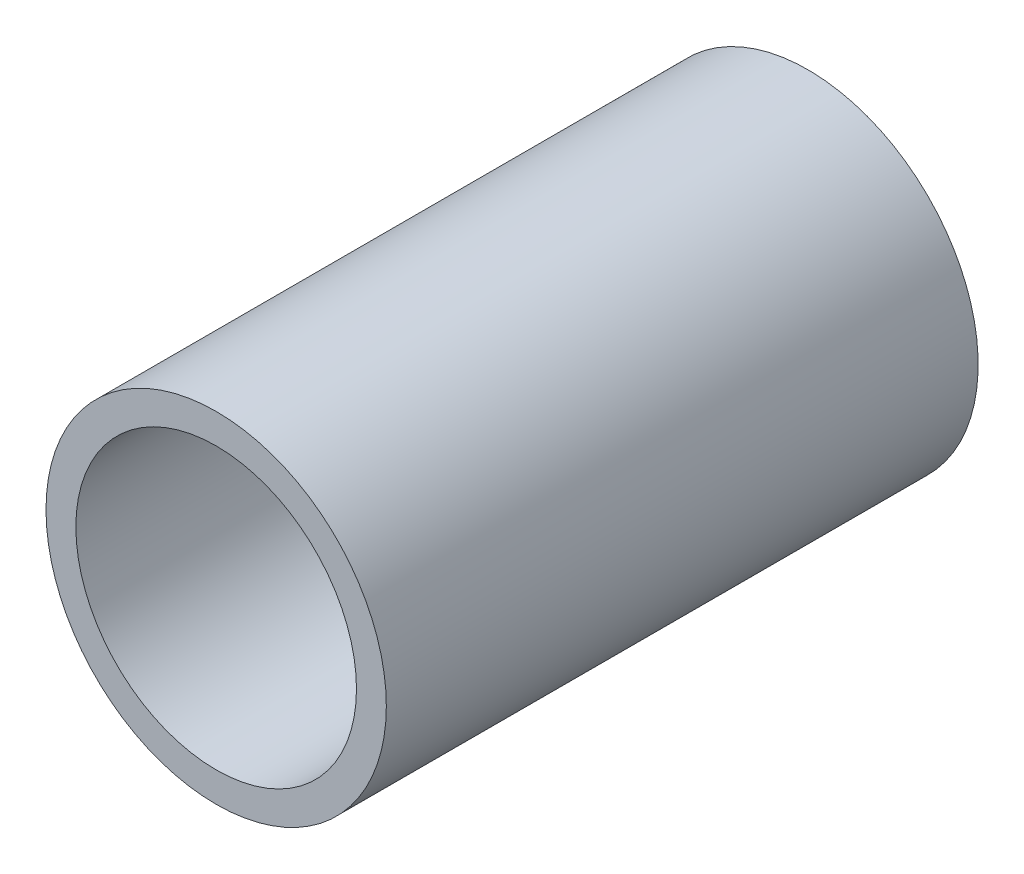
ISO-10303-21;
HEADER;
FILE_DESCRIPTION(('STEP AP214'),'2;1');
FILE_NAME('part.step','',(''),(''),'','','');
FILE_SCHEMA(('AUTOMOTIVE_DESIGN { 1 0 10303 214 1 1 1 1 }'));
ENDSEC;
DATA;
#1=APPLICATION_CONTEXT('core data for automotive mechanical design processes');
#2=APPLICATION_PROTOCOL_DEFINITION('international standard','automotive_design',2000,#1);
#3=PRODUCT_CONTEXT('',#1,'mechanical');
#4=PRODUCT('Part','Part','',(#3));
#5=PRODUCT_RELATED_PRODUCT_CATEGORY('part','',(#4));
#6=PRODUCT_DEFINITION_FORMATION('','',#4);
#7=PRODUCT_DEFINITION_CONTEXT('part definition',#1,'design');
#8=PRODUCT_DEFINITION('design','',#6,#7);
#9=PRODUCT_DEFINITION_SHAPE('','',#8);
#10=(LENGTH_UNIT() NAMED_UNIT(*) SI_UNIT(.MILLI.,.METRE.));
#11=(NAMED_UNIT(*) PLANE_ANGLE_UNIT() SI_UNIT($,.RADIAN.));
#12=(NAMED_UNIT(*) SI_UNIT($,.STERADIAN.) SOLID_ANGLE_UNIT());
#13=UNCERTAINTY_MEASURE_WITH_UNIT(LENGTH_MEASURE(1.E-05),#10,'distance_accuracy_value','');
#14=(GEOMETRIC_REPRESENTATION_CONTEXT(3) GLOBAL_UNCERTAINTY_ASSIGNED_CONTEXT((#13)) GLOBAL_UNIT_ASSIGNED_CONTEXT((#10,
#11,#12)) REPRESENTATION_CONTEXT('',''));
#15=CARTESIAN_POINT('',(0.,0.,0.));
#16=DIRECTION('',(0.,0.,1.));
#17=DIRECTION('',(1.,0.,0.));
#18=AXIS2_PLACEMENT_3D('',#15,#16,#17);
#19=CARTESIAN_POINT('',(0.,0.,-2.302));
#20=DIRECTION('',(0.,0.,1.));
#21=DIRECTION('',(1.,0.,0.));
#22=AXIS2_PLACEMENT_3D('',#19,#20,#21);
#23=CYLINDRICAL_SURFACE('',#22,4.7);
#24=CARTESIAN_POINT('',(0.,0.,19.189));
#25=DIRECTION('',(0.,0.,1.));
#26=DIRECTION('',(1.,0.,0.));
#27=AXIS2_PLACEMENT_3D('',#24,#25,#26);
#28=CIRCLE('',#27,4.7);
#29=CARTESIAN_POINT('',(4.7,0.,19.189));
#30=VERTEX_POINT('',#29);
#31=EDGE_CURVE('E10',#30,#30,#28,.F.);
#32=ORIENTED_EDGE('',*,*,#31,.F.);
#33=EDGE_LOOP('',(#32));
#34=FACE_BOUND('',#33,.T.);
#35=CARTESIAN_POINT('',(0.,0.,11.176));
#36=DIRECTION('',(0.,0.,-1.));
#37=DIRECTION('',(-1.,0.,0.));
#38=AXIS2_PLACEMENT_3D('',#35,#36,#37);
#39=CIRCLE('',#38,4.7);
#40=CARTESIAN_POINT('',(-4.7,0.,11.176));
#41=VERTEX_POINT('',#40);
#42=EDGE_CURVE('E74',#41,#41,#39,.T.);
#43=ORIENTED_EDGE('',*,*,#42,.T.);
#44=EDGE_LOOP('',(#43));
#45=FACE_BOUND('',#44,.T.);
#46=ADVANCED_FACE('F38',(#34,#45),#23,.F.);
#47=CARTESIAN_POINT('',(0.,0.,31.));
#48=DIRECTION('',(0.,0.,-1.));
#49=DIRECTION('',(-1.,0.,0.));
#50=AXIS2_PLACEMENT_3D('',#47,#48,#49);
#51=CYLINDRICAL_SURFACE('',#50,5.7);
#52=CARTESIAN_POINT('',(0.,0.,31.));
#53=DIRECTION('',(0.,0.,1.));
#54=DIRECTION('',(1.,0.,0.));
#55=AXIS2_PLACEMENT_3D('',#52,#53,#54);
#56=CIRCLE('',#55,5.7);
#57=CARTESIAN_POINT('',(5.7,0.,31.));
#58=VERTEX_POINT('',#57);
#59=EDGE_CURVE('E46',#58,#58,#56,.T.);
#60=ORIENTED_EDGE('',*,*,#59,.F.);
#61=EDGE_LOOP('',(#60));
#62=FACE_BOUND('',#61,.T.);
#63=CARTESIAN_POINT('',(0.,0.,11.176));
#64=DIRECTION('',(0.,0.,-1.));
#65=DIRECTION('',(-1.,0.,0.));
#66=AXIS2_PLACEMENT_3D('',#63,#64,#65);
#67=CIRCLE('',#66,5.7);
#68=CARTESIAN_POINT('',(-5.7,0.,11.176));
#69=VERTEX_POINT('',#68);
#70=EDGE_CURVE('E67',#69,#69,#67,.T.);
#71=ORIENTED_EDGE('',*,*,#70,.F.);
#72=EDGE_LOOP('',(#71));
#73=FACE_BOUND('',#72,.T.);
#74=ADVANCED_FACE('F40',(#62,#73),#51,.T.);
#75=CARTESIAN_POINT('',(0.,0.,31.));
#76=DIRECTION('',(0.,0.,1.));
#77=DIRECTION('',(1.,0.,0.));
#78=AXIS2_PLACEMENT_3D('',#75,#76,#77);
#79=PLANE('',#78);
#80=CARTESIAN_POINT('',(0.,0.,31.));
#81=DIRECTION('',(0.,0.,1.));
#82=DIRECTION('',(1.,0.,0.));
#83=AXIS2_PLACEMENT_3D('',#80,#81,#82);
#84=CIRCLE('',#83,4.7);
#85=CARTESIAN_POINT('',(4.7,0.,31.));
#86=VERTEX_POINT('',#85);
#87=EDGE_CURVE('E51',#86,#86,#84,.T.);
#88=ORIENTED_EDGE('',*,*,#87,.F.);
#89=EDGE_LOOP('',(#88));
#90=FACE_BOUND('',#89,.T.);
#91=ORIENTED_EDGE('',*,*,#59,.T.);
#92=EDGE_LOOP('',(#91));
#93=FACE_BOUND('',#92,.T.);
#94=ADVANCED_FACE('F88',(#90,#93),#79,.T.);
#95=CARTESIAN_POINT('',(0.,0.,19.824));
#96=DIRECTION('',(0.,0.,1.));
#97=DIRECTION('',(1.,0.,0.));
#98=AXIS2_PLACEMENT_3D('',#95,#96,#97);
#99=CIRCLE('',#98,4.7);
#100=CARTESIAN_POINT('',(4.7,0.,19.824));
#101=VERTEX_POINT('',#100);
#102=EDGE_CURVE('E56',#101,#101,#99,.T.);
#103=ORIENTED_EDGE('',*,*,#102,.F.);
#104=EDGE_LOOP('',(#103));
#105=FACE_BOUND('',#104,.T.);
#106=ORIENTED_EDGE('',*,*,#87,.T.);
#107=EDGE_LOOP('',(#106));
#108=FACE_BOUND('',#107,.T.);
#109=ADVANCED_FACE('F95',(#105,#108),#23,.F.);
#110=CARTESIAN_POINT('',(0.,0.,19.189));
#111=DIRECTION('',(0.,0.,1.));
#112=DIRECTION('',(1.,0.,0.));
#113=AXIS2_PLACEMENT_3D('',#110,#111,#112);
#114=PLANE('',#113);
#115=CARTESIAN_POINT('',(0.,0.,19.189));
#116=DIRECTION('',(0.,0.,1.));
#117=DIRECTION('',(1.,0.,0.));
#118=AXIS2_PLACEMENT_3D('',#115,#116,#117);
#119=CIRCLE('',#118,4.192);
#120=CARTESIAN_POINT('',(4.192,0.,19.189));
#121=VERTEX_POINT('',#120);
#122=EDGE_CURVE('E62',#121,#121,#119,.T.);
#123=ORIENTED_EDGE('',*,*,#122,.T.);
#124=EDGE_LOOP('',(#123));
#125=FACE_BOUND('',#124,.T.);
#126=ORIENTED_EDGE('',*,*,#31,.T.);
#127=EDGE_LOOP('',(#126));
#128=FACE_BOUND('',#127,.T.);
#129=ADVANCED_FACE('F104',(#125,#128),#114,.F.);
#130=CARTESIAN_POINT('',(0.,0.,19.824));
#131=DIRECTION('',(0.,0.,1.));
#132=DIRECTION('',(1.,0.,0.));
#133=AXIS2_PLACEMENT_3D('',#130,#131,#132);
#134=PLANE('',#133);
#135=CARTESIAN_POINT('',(0.,0.,19.824));
#136=DIRECTION('',(0.,0.,1.));
#137=DIRECTION('',(1.,0.,0.));
#138=AXIS2_PLACEMENT_3D('',#135,#136,#137);
#139=CIRCLE('',#138,4.192);
#140=CARTESIAN_POINT('',(4.192,0.,19.824));
#141=VERTEX_POINT('',#140);
#142=EDGE_CURVE('E63',#141,#141,#139,.T.);
#143=ORIENTED_EDGE('',*,*,#142,.F.);
#144=EDGE_LOOP('',(#143));
#145=FACE_BOUND('',#144,.T.);
#146=ORIENTED_EDGE('',*,*,#102,.T.);
#147=EDGE_LOOP('',(#146));
#148=FACE_BOUND('',#147,.T.);
#149=ADVANCED_FACE('F109',(#145,#148),#134,.T.);
#150=CARTESIAN_POINT('',(0.,0.,19.189));
#151=DIRECTION('',(0.,0.,1.));
#152=DIRECTION('',(1.,0.,0.));
#153=AXIS2_PLACEMENT_3D('',#150,#151,#152);
#154=CYLINDRICAL_SURFACE('',#153,4.192);
#155=ORIENTED_EDGE('',*,*,#122,.F.);
#156=EDGE_LOOP('',(#155));
#157=FACE_BOUND('',#156,.T.);
#158=ORIENTED_EDGE('',*,*,#142,.T.);
#159=EDGE_LOOP('',(#158));
#160=FACE_BOUND('',#159,.T.);
#161=ADVANCED_FACE('F83',(#157,#160),#154,.F.);
#162=CARTESIAN_POINT('',(0.,0.,11.176));
#163=DIRECTION('',(0.,0.,-1.));
#164=DIRECTION('',(-1.,0.,0.));
#165=AXIS2_PLACEMENT_3D('',#162,#163,#164);
#166=PLANE('',#165);
#167=ORIENTED_EDGE('',*,*,#42,.F.);
#168=EDGE_LOOP('',(#167));
#169=FACE_BOUND('',#168,.T.);
#170=ORIENTED_EDGE('',*,*,#70,.T.);
#171=EDGE_LOOP('',(#170));
#172=FACE_BOUND('',#171,.T.);
#173=ADVANCED_FACE('F80',(#169,#172),#166,.T.);
#174=CLOSED_SHELL('',(#46,#74,#94,#109,#129,#149,#161,#173));
#175=MANIFOLD_SOLID_BREP('B2',#174);
#176=ADVANCED_BREP_SHAPE_REPRESENTATION('',(#18,#175),#14);
#177=SHAPE_DEFINITION_REPRESENTATION(#9,#176);
ENDSEC;
END-ISO-10303-21;
